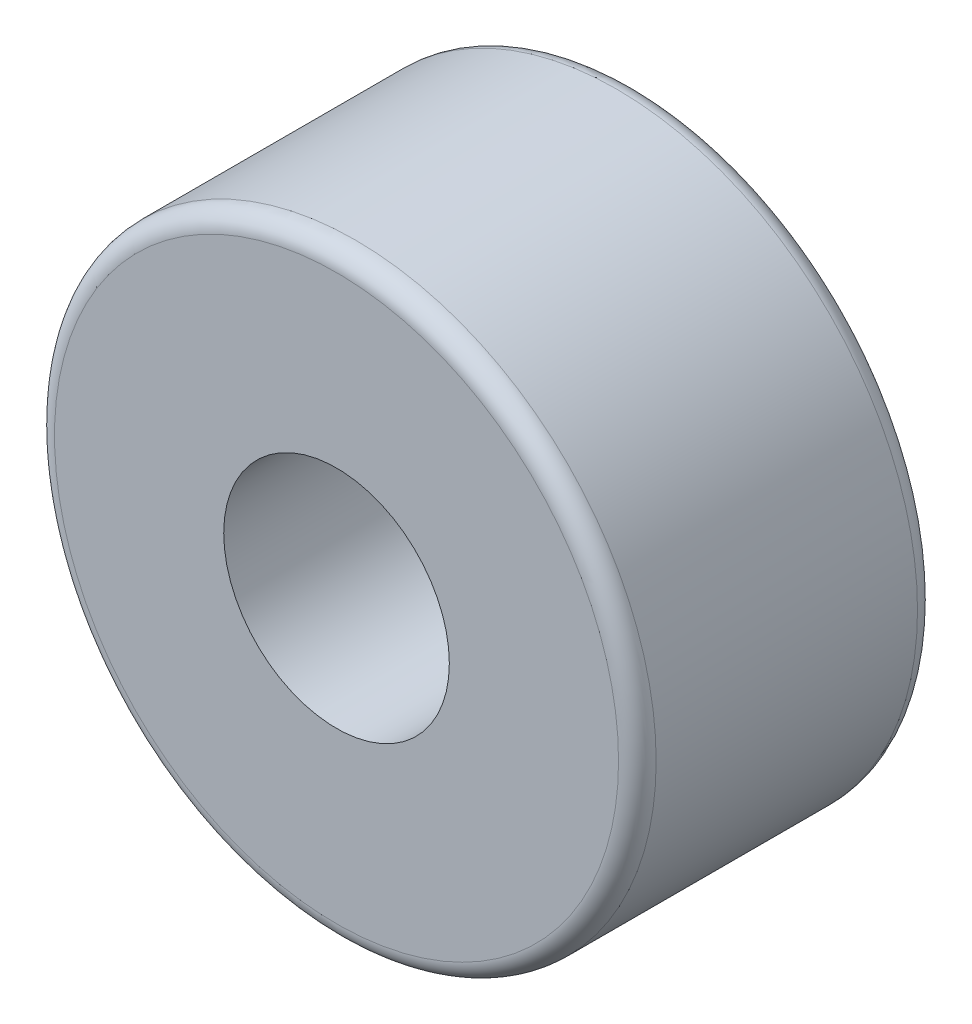
ISO-10303-21;
HEADER;
FILE_DESCRIPTION(('STEP AP214'),'2;1');
FILE_NAME('part.step','',(''),(''),'','','');
FILE_SCHEMA(('AUTOMOTIVE_DESIGN { 1 0 10303 214 1 1 1 1 }'));
ENDSEC;
DATA;
#1=APPLICATION_CONTEXT('core data for automotive mechanical design processes');
#2=APPLICATION_PROTOCOL_DEFINITION('international standard','automotive_design',2000,#1);
#3=PRODUCT_CONTEXT('',#1,'mechanical');
#4=PRODUCT('Part','Part','',(#3));
#5=PRODUCT_RELATED_PRODUCT_CATEGORY('part','',(#4));
#6=PRODUCT_DEFINITION_FORMATION('','',#4);
#7=PRODUCT_DEFINITION_CONTEXT('part definition',#1,'design');
#8=PRODUCT_DEFINITION('design','',#6,#7);
#9=PRODUCT_DEFINITION_SHAPE('','',#8);
#10=(LENGTH_UNIT() NAMED_UNIT(*) SI_UNIT(.MILLI.,.METRE.));
#11=(NAMED_UNIT(*) PLANE_ANGLE_UNIT() SI_UNIT($,.RADIAN.));
#12=(NAMED_UNIT(*) SI_UNIT($,.STERADIAN.) SOLID_ANGLE_UNIT());
#13=UNCERTAINTY_MEASURE_WITH_UNIT(LENGTH_MEASURE(1.E-05),#10,'distance_accuracy_value','');
#14=(GEOMETRIC_REPRESENTATION_CONTEXT(3) GLOBAL_UNCERTAINTY_ASSIGNED_CONTEXT((#13)) GLOBAL_UNIT_ASSIGNED_CONTEXT((#10,
#11,#12)) REPRESENTATION_CONTEXT('',''));
#15=CARTESIAN_POINT('',(0.,0.,0.));
#16=DIRECTION('',(0.,0.,1.));
#17=DIRECTION('',(1.,0.,0.));
#18=AXIS2_PLACEMENT_3D('',#15,#16,#17);
#19=CARTESIAN_POINT('',(0.,0.,15.9));
#20=DIRECTION('',(0.,0.,1.));
#21=DIRECTION('',(1.,0.,0.));
#22=AXIS2_PLACEMENT_3D('',#19,#20,#21);
#23=PLANE('',#22);
#24=CARTESIAN_POINT('',(0.,0.,15.9));
#25=DIRECTION('',(0.,0.,1.));
#26=DIRECTION('',(1.,0.,0.));
#27=AXIS2_PLACEMENT_3D('',#24,#25,#26);
#28=CIRCLE('',#27,15.);
#29=CARTESIAN_POINT('',(15.,0.,15.9));
#30=VERTEX_POINT('',#29);
#31=EDGE_CURVE('E10',#30,#30,#28,.T.);
#32=ORIENTED_EDGE('',*,*,#31,.T.);
#33=EDGE_LOOP('',(#32));
#34=FACE_BOUND('',#33,.T.);
#35=CARTESIAN_POINT('',(0.,0.,15.9));
#36=DIRECTION('',(0.,0.,1.));
#37=DIRECTION('',(1.,0.,0.));
#38=AXIS2_PLACEMENT_3D('',#35,#36,#37);
#39=CIRCLE('',#38,6.);
#40=CARTESIAN_POINT('',(6.,0.,15.9));
#41=VERTEX_POINT('',#40);
#42=EDGE_CURVE('E61',#41,#41,#39,.T.);
#43=ORIENTED_EDGE('',*,*,#42,.F.);
#44=EDGE_LOOP('',(#43));
#45=FACE_BOUND('',#44,.T.);
#46=ADVANCED_FACE('F37',(#34,#45),#23,.T.);
#47=CARTESIAN_POINT('',(0.,0.,0.));
#48=DIRECTION('',(0.,0.,1.));
#49=DIRECTION('',(1.,0.,0.));
#50=AXIS2_PLACEMENT_3D('',#47,#48,#49);
#51=PLANE('',#50);
#52=CARTESIAN_POINT('',(0.,0.,0.));
#53=DIRECTION('',(0.,0.,1.));
#54=DIRECTION('',(1.,0.,0.));
#55=AXIS2_PLACEMENT_3D('',#52,#53,#54);
#56=CIRCLE('',#55,15.);
#57=CARTESIAN_POINT('',(15.,0.,0.));
#58=VERTEX_POINT('',#57);
#59=EDGE_CURVE('E45',#58,#58,#56,.F.);
#60=ORIENTED_EDGE('',*,*,#59,.T.);
#61=EDGE_LOOP('',(#60));
#62=FACE_BOUND('',#61,.T.);
#63=CARTESIAN_POINT('',(0.,0.,0.));
#64=DIRECTION('',(0.,0.,1.));
#65=DIRECTION('',(1.,0.,0.));
#66=AXIS2_PLACEMENT_3D('',#63,#64,#65);
#67=CIRCLE('',#66,6.);
#68=CARTESIAN_POINT('',(6.,0.,0.));
#69=VERTEX_POINT('',#68);
#70=EDGE_CURVE('E62',#69,#69,#67,.T.);
#71=ORIENTED_EDGE('',*,*,#70,.T.);
#72=EDGE_LOOP('',(#71));
#73=FACE_BOUND('',#72,.T.);
#74=ADVANCED_FACE('F74',(#62,#73),#51,.F.);
#75=CARTESIAN_POINT('',(0.,0.,15.9));
#76=DIRECTION('',(0.,0.,-1.));
#77=DIRECTION('',(-1.,0.,0.));
#78=AXIS2_PLACEMENT_3D('',#75,#76,#77);
#79=CYLINDRICAL_SURFACE('',#78,16.);
#80=CARTESIAN_POINT('',(0.,0.,1.));
#81=DIRECTION('',(0.,0.,1.));
#82=DIRECTION('',(1.,0.,0.));
#83=AXIS2_PLACEMENT_3D('',#80,#81,#82);
#84=CIRCLE('',#83,16.);
#85=CARTESIAN_POINT('',(16.,0.,1.));
#86=VERTEX_POINT('',#85);
#87=EDGE_CURVE('E50',#86,#86,#84,.T.);
#88=ORIENTED_EDGE('',*,*,#87,.T.);
#89=EDGE_LOOP('',(#88));
#90=FACE_BOUND('',#89,.T.);
#91=CARTESIAN_POINT('',(0.,0.,14.9));
#92=DIRECTION('',(0.,0.,1.));
#93=DIRECTION('',(1.,0.,0.));
#94=AXIS2_PLACEMENT_3D('',#91,#92,#93);
#95=CIRCLE('',#94,16.);
#96=CARTESIAN_POINT('',(16.,0.,14.9));
#97=VERTEX_POINT('',#96);
#98=EDGE_CURVE('E55',#97,#97,#95,.F.);
#99=ORIENTED_EDGE('',*,*,#98,.T.);
#100=EDGE_LOOP('',(#99));
#101=FACE_BOUND('',#100,.T.);
#102=ADVANCED_FACE('F79',(#90,#101),#79,.T.);
#103=CARTESIAN_POINT('',(0.,0.,15.9));
#104=DIRECTION('',(0.,0.,-1.));
#105=DIRECTION('',(-1.,0.,0.));
#106=AXIS2_PLACEMENT_3D('',#103,#104,#105);
#107=CYLINDRICAL_SURFACE('',#106,6.);
#108=ORIENTED_EDGE('',*,*,#42,.T.);
#109=EDGE_LOOP('',(#108));
#110=FACE_BOUND('',#109,.T.);
#111=ORIENTED_EDGE('',*,*,#70,.F.);
#112=EDGE_LOOP('',(#111));
#113=FACE_BOUND('',#112,.T.);
#114=ADVANCED_FACE('F70',(#110,#113),#107,.F.);
#115=CARTESIAN_POINT('',(0.,0.,1.));
#116=DIRECTION('',(0.,0.,1.));
#117=DIRECTION('',(1.,0.,0.));
#118=AXIS2_PLACEMENT_3D('',#115,#116,#117);
#119=TOROIDAL_SURFACE('',#118,15.,1.);
#120=ORIENTED_EDGE('',*,*,#59,.F.);
#121=EDGE_LOOP('',(#120));
#122=FACE_BOUND('',#121,.T.);
#123=ORIENTED_EDGE('',*,*,#87,.F.);
#124=EDGE_LOOP('',(#123));
#125=FACE_BOUND('',#124,.T.);
#126=ADVANCED_FACE('F85',(#122,#125),#119,.T.);
#127=CARTESIAN_POINT('',(0.,0.,14.9));
#128=DIRECTION('',(0.,0.,1.));
#129=DIRECTION('',(1.,0.,0.));
#130=AXIS2_PLACEMENT_3D('',#127,#128,#129);
#131=TOROIDAL_SURFACE('',#130,15.,1.);
#132=ORIENTED_EDGE('',*,*,#98,.F.);
#133=EDGE_LOOP('',(#132));
#134=FACE_BOUND('',#133,.T.);
#135=ORIENTED_EDGE('',*,*,#31,.F.);
#136=EDGE_LOOP('',(#135));
#137=FACE_BOUND('',#136,.T.);
#138=ADVANCED_FACE('F39',(#134,#137),#131,.T.);
#139=CLOSED_SHELL('',(#46,#74,#102,#114,#126,#138));
#140=MANIFOLD_SOLID_BREP('B2',#139);
#141=ADVANCED_BREP_SHAPE_REPRESENTATION('',(#18,#140),#14);
#142=SHAPE_DEFINITION_REPRESENTATION(#9,#141);
ENDSEC;
END-ISO-10303-21;
